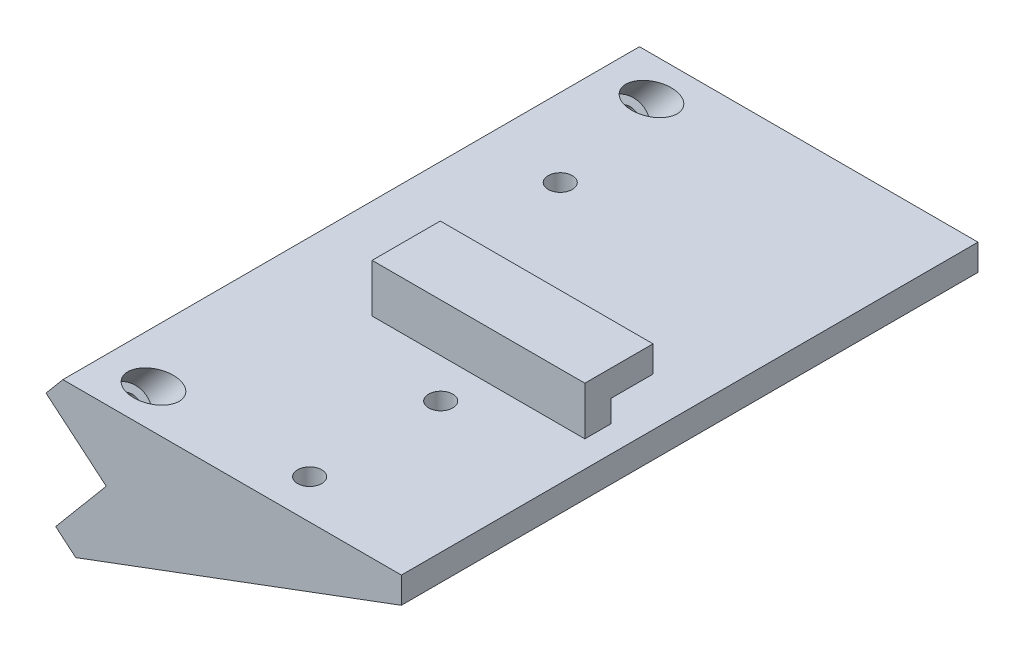
ISO-10303-21;
HEADER;
FILE_DESCRIPTION(('STEP AP214'),'2;1');
FILE_NAME('part.step','',(''),(''),'','','');
FILE_SCHEMA(('AUTOMOTIVE_DESIGN { 1 0 10303 214 1 1 1 1 }'));
ENDSEC;
DATA;
#1=APPLICATION_CONTEXT('core data for automotive mechanical design processes');
#2=APPLICATION_PROTOCOL_DEFINITION('international standard','automotive_design',2000,#1);
#3=PRODUCT_CONTEXT('',#1,'mechanical');
#4=PRODUCT('Part','Part','',(#3));
#5=PRODUCT_RELATED_PRODUCT_CATEGORY('part','',(#4));
#6=PRODUCT_DEFINITION_FORMATION('','',#4);
#7=PRODUCT_DEFINITION_CONTEXT('part definition',#1,'design');
#8=PRODUCT_DEFINITION('design','',#6,#7);
#9=PRODUCT_DEFINITION_SHAPE('','',#8);
#10=(LENGTH_UNIT() NAMED_UNIT(*) SI_UNIT(.MILLI.,.METRE.));
#11=(NAMED_UNIT(*) PLANE_ANGLE_UNIT() SI_UNIT($,.RADIAN.));
#12=(NAMED_UNIT(*) SI_UNIT($,.STERADIAN.) SOLID_ANGLE_UNIT());
#13=UNCERTAINTY_MEASURE_WITH_UNIT(LENGTH_MEASURE(1.E-05),#10,'distance_accuracy_value','');
#14=(GEOMETRIC_REPRESENTATION_CONTEXT(3) GLOBAL_UNCERTAINTY_ASSIGNED_CONTEXT((#13)) GLOBAL_UNIT_ASSIGNED_CONTEXT((#10,
#11,#12)) REPRESENTATION_CONTEXT('',''));
#15=CARTESIAN_POINT('',(0.,0.,0.));
#16=DIRECTION('',(0.,0.,1.));
#17=DIRECTION('',(1.,0.,0.));
#18=AXIS2_PLACEMENT_3D('',#15,#16,#17);
#19=CARTESIAN_POINT('',(0.,0.,65.));
#20=DIRECTION('',(0.,0.,1.));
#21=DIRECTION('',(1.,0.,0.));
#22=AXIS2_PLACEMENT_3D('',#19,#20,#21);
#23=PLANE('',#22);
#24=DIRECTION('',(-1.,0.,0.));
#25=VECTOR('',#24,1.);
#26=CARTESIAN_POINT('',(65.9461948869302,29.1627030076777,65.));
#27=LINE('',#26,#25);
#28=CARTESIAN_POINT('',(60.9461948869302,29.1627030076777,65.));
#29=VERTEX_POINT('',#28);
#30=CARTESIAN_POINT('',(20.364802153777,29.1627030076777,65.));
#31=VERTEX_POINT('',#30);
#32=EDGE_CURVE('E191',#29,#31,#27,.T.);
#33=ORIENTED_EDGE('',*,*,#32,.F.);
#34=DIRECTION('',(0.,1.,0.));
#35=VECTOR('',#34,1.);
#36=CARTESIAN_POINT('',(60.9461948869302,24.9627030076777,65.));
#37=LINE('',#36,#35);
#38=CARTESIAN_POINT('',(60.9461948869302,24.9627030076777,65.));
#39=VERTEX_POINT('',#38);
#40=EDGE_CURVE('E149',#39,#29,#37,.T.);
#41=ORIENTED_EDGE('',*,*,#40,.F.);
#42=DIRECTION('',(-1.,0.,0.));
#43=VECTOR('',#42,1.);
#44=CARTESIAN_POINT('',(1.36508554694607,24.9627030076777,65.));
#45=LINE('',#44,#43);
#46=CARTESIAN_POINT('',(20.364802153777,24.9627030076777,65.));
#47=VERTEX_POINT('',#46);
#48=EDGE_CURVE('E147',#39,#47,#45,.T.);
#49=ORIENTED_EDGE('',*,*,#48,.T.);
#50=DIRECTION('',(0.,1.,0.));
#51=VECTOR('',#50,1.);
#52=CARTESIAN_POINT('',(20.364802153777,0.,65.));
#53=LINE('',#52,#51);
#54=EDGE_CURVE('E184',#47,#31,#53,.T.);
#55=ORIENTED_EDGE('',*,*,#54,.T.);
#56=EDGE_LOOP('',(#33,#41,#49,#55));
#57=FACE_BOUND('',#56,.T.);
#58=ADVANCED_FACE('F41',(#57),#23,.F.);
#59=CARTESIAN_POINT('',(3.8302222155949,-3.21393804843269,65.));
#60=DIRECTION('',(0.642787609686537,0.766044443118979,0.));
#61=DIRECTION('',(-0.76604444311898,0.642787609686537,0.));
#62=AXIS2_PLACEMENT_3D('',#59,#60,#61);
#63=PLANE('',#62);
#64=DIRECTION('',(0.76604444311898,-0.642787609686537,0.));
#65=VECTOR('',#64,1.);
#66=CARTESIAN_POINT('',(3.8302222155949,-3.21393804843269,0.));
#67=LINE('',#66,#65);
#68=CARTESIAN_POINT('',(0.,0.,0.));
#69=VERTEX_POINT('',#68);
#70=CARTESIAN_POINT('',(3.8302222155949,-3.21393804843269,0.));
#71=VERTEX_POINT('',#70);
#72=EDGE_CURVE('E202',#69,#71,#67,.T.);
#73=ORIENTED_EDGE('',*,*,#72,.T.);
#74=DIRECTION('',(0.,0.,-1.));
#75=VECTOR('',#74,1.);
#76=CARTESIAN_POINT('',(3.8302222155949,-3.21393804843269,65.));
#77=LINE('',#76,#75);
#78=CARTESIAN_POINT('',(3.8302222155949,-3.21393804843269,110.));
#79=VERTEX_POINT('',#78);
#80=EDGE_CURVE('E11',#79,#71,#77,.T.);
#81=ORIENTED_EDGE('',*,*,#80,.F.);
#82=DIRECTION('',(0.76604444311898,-0.642787609686537,0.));
#83=VECTOR('',#82,1.);
#84=CARTESIAN_POINT('',(0.,0.,110.));
#85=LINE('',#84,#83);
#86=CARTESIAN_POINT('',(0.,0.,110.));
#87=VERTEX_POINT('',#86);
#88=EDGE_CURVE('E173',#87,#79,#85,.T.);
#89=ORIENTED_EDGE('',*,*,#88,.F.);
#90=DIRECTION('',(0.,0.,-1.));
#91=VECTOR('',#90,1.);
#92=CARTESIAN_POINT('',(0.,0.,65.));
#93=LINE('',#92,#91);
#94=EDGE_CURVE('E204',#87,#69,#93,.T.);
#95=ORIENTED_EDGE('',*,*,#94,.T.);
#96=EDGE_LOOP('',(#73,#81,#89,#95));
#97=FACE_BOUND('',#96,.T.);
#98=ADVANCED_FACE('F43',(#97),#63,.F.);
#99=CARTESIAN_POINT('',(65.9461948869302,19.9627030076777,65.));
#100=DIRECTION('',(-0.349577800367252,0.936907338796315,0.));
#101=DIRECTION('',(-0.936907338796315,-0.349577800367252,0.));
#102=AXIS2_PLACEMENT_3D('',#99,#100,#101);
#103=PLANE('',#102);
#104=DIRECTION('',(0.936907338796315,0.349577800367252,0.));
#105=VECTOR('',#104,1.);
#106=CARTESIAN_POINT('',(65.9461948869302,19.9627030076777,0.));
#107=LINE('',#106,#105);
#108=CARTESIAN_POINT('',(65.9461948869302,19.9627030076777,0.));
#109=VERTEX_POINT('',#108);
#110=EDGE_CURVE('E208',#71,#109,#107,.T.);
#111=ORIENTED_EDGE('',*,*,#110,.T.);
#112=DIRECTION('',(0.,0.,-1.));
#113=VECTOR('',#112,1.);
#114=CARTESIAN_POINT('',(65.9461948869302,19.9627030076777,65.));
#115=LINE('',#114,#113);
#116=CARTESIAN_POINT('',(65.9461948869302,19.9627030076777,110.));
#117=VERTEX_POINT('',#116);
#118=EDGE_CURVE('E50',#117,#109,#115,.T.);
#119=ORIENTED_EDGE('',*,*,#118,.F.);
#120=DIRECTION('',(0.936907338796315,0.349577800367252,0.));
#121=VECTOR('',#120,1.);
#122=CARTESIAN_POINT('',(3.8302222155949,-3.21393804843269,110.));
#123=LINE('',#122,#121);
#124=EDGE_CURVE('E162',#79,#117,#123,.T.);
#125=ORIENTED_EDGE('',*,*,#124,.F.);
#126=ORIENTED_EDGE('',*,*,#80,.T.);
#127=EDGE_LOOP('',(#111,#119,#125,#126));
#128=FACE_BOUND('',#127,.T.);
#129=ADVANCED_FACE('F276',(#128),#103,.F.);
#130=CARTESIAN_POINT('',(65.9461948869302,24.9627030076777,65.));
#131=DIRECTION('',(-1.,0.,0.));
#132=DIRECTION('',(0.,-1.,0.));
#133=AXIS2_PLACEMENT_3D('',#130,#131,#132);
#134=PLANE('',#133);
#135=DIRECTION('',(0.,0.,-1.));
#136=VECTOR('',#135,1.);
#137=CARTESIAN_POINT('',(65.9461948869302,24.9627030076777,65.));
#138=LINE('',#137,#136);
#139=CARTESIAN_POINT('',(65.9461948869302,24.9627030076777,110.));
#140=VERTEX_POINT('',#139);
#141=CARTESIAN_POINT('',(65.9461948869302,24.9627030076777,0.));
#142=VERTEX_POINT('',#141);
#143=EDGE_CURVE('E230',#140,#142,#138,.T.);
#144=ORIENTED_EDGE('',*,*,#143,.F.);
#145=DIRECTION('',(0.,1.,0.));
#146=VECTOR('',#145,1.);
#147=CARTESIAN_POINT('',(65.9461948869302,19.9627030076777,110.));
#148=LINE('',#147,#146);
#149=EDGE_CURVE('E166',#117,#140,#148,.T.);
#150=ORIENTED_EDGE('',*,*,#149,.F.);
#151=ORIENTED_EDGE('',*,*,#118,.T.);
#152=DIRECTION('',(0.,1.,0.));
#153=VECTOR('',#152,1.);
#154=CARTESIAN_POINT('',(65.9461948869302,24.9627030076777,0.));
#155=LINE('',#154,#153);
#156=EDGE_CURVE('E210',#109,#142,#155,.T.);
#157=ORIENTED_EDGE('',*,*,#156,.T.);
#158=EDGE_LOOP('',(#144,#150,#151,#157));
#159=FACE_BOUND('',#158,.T.);
#160=ADVANCED_FACE('F280',(#159),#134,.F.);
#161=CARTESIAN_POINT('',(1.36508554694607,24.9627030076777,65.));
#162=DIRECTION('',(0.,-1.,0.));
#163=DIRECTION('',(1.,0.,0.));
#164=AXIS2_PLACEMENT_3D('',#161,#162,#163);
#165=PLANE('',#164);
#166=ORIENTED_EDGE('',*,*,#48,.F.);
#167=DIRECTION('',(0.,0.,-1.));
#168=VECTOR('',#167,1.);
#169=CARTESIAN_POINT('',(60.9461948869302,24.9627030076777,70.));
#170=LINE('',#169,#168);
#171=CARTESIAN_POINT('',(60.9461948869302,24.9627030076777,70.));
#172=VERTEX_POINT('',#171);
#173=EDGE_CURVE('E139',#172,#39,#170,.T.);
#174=ORIENTED_EDGE('',*,*,#173,.F.);
#175=DIRECTION('',(-1.,0.,0.));
#176=VECTOR('',#175,1.);
#177=CARTESIAN_POINT('',(65.9461948869302,24.9627030076777,70.));
#178=LINE('',#177,#176);
#179=CARTESIAN_POINT('',(20.364802153777,24.9627030076777,70.));
#180=VERTEX_POINT('',#179);
#181=EDGE_CURVE('E145',#172,#180,#178,.T.);
#182=ORIENTED_EDGE('',*,*,#181,.T.);
#183=DIRECTION('',(0.,0.,-1.));
#184=VECTOR('',#183,1.);
#185=CARTESIAN_POINT('',(20.364802153777,24.9627030076777,70.));
#186=LINE('',#185,#184);
#187=EDGE_CURVE('E178',#180,#47,#186,.T.);
#188=ORIENTED_EDGE('',*,*,#187,.T.);
#189=EDGE_LOOP('',(#166,#174,#182,#188));
#190=FACE_BOUND('',#189,.T.);
#191=CARTESIAN_POINT('',(40.9461948869302,24.9627030076777,77.5));
#192=DIRECTION('',(0.,1.,0.));
#193=DIRECTION('',(0.,0.,1.));
#194=AXIS2_PLACEMENT_3D('',#191,#192,#193);
#195=CIRCLE('',#194,2.3);
#196=CARTESIAN_POINT('',(40.9461948869302,24.9627030076777,79.8));
#197=VERTEX_POINT('',#196);
#198=EDGE_CURVE('E620',#197,#197,#195,.T.);
#199=ORIENTED_EDGE('',*,*,#198,.F.);
#200=EDGE_LOOP('',(#199));
#201=FACE_BOUND('',#200,.T.);
#202=CARTESIAN_POINT('',(40.9461948869302,24.9627030076777,102.5));
#203=DIRECTION('',(0.,1.,0.));
#204=DIRECTION('',(0.,0.,1.));
#205=AXIS2_PLACEMENT_3D('',#202,#203,#204);
#206=CIRCLE('',#205,2.3);
#207=CARTESIAN_POINT('',(40.9461948869302,24.9627030076777,104.8));
#208=VERTEX_POINT('',#207);
#209=EDGE_CURVE('E626',#208,#208,#206,.T.);
#210=ORIENTED_EDGE('',*,*,#209,.F.);
#211=EDGE_LOOP('',(#210));
#212=FACE_BOUND('',#211,.T.);
#213=CARTESIAN_POINT('',(11.1556402169381,24.9627030076777,102.5));
#214=DIRECTION('',(0.,-1.,0.));
#215=DIRECTION('',(-1.,0.,0.));
#216=AXIS2_PLACEMENT_3D('',#213,#214,#215);
#217=ELLIPSE('',#216,4.89527733499604,3.75);
#218=CARTESIAN_POINT('',(6.26036288194211,24.9627030076777,102.5));
#219=VERTEX_POINT('',#218);
#220=EDGE_CURVE('E45',#219,#219,#217,.T.);
#221=ORIENTED_EDGE('',*,*,#220,.T.);
#222=EDGE_LOOP('',(#221));
#223=FACE_BOUND('',#222,.T.);
#224=CARTESIAN_POINT('',(11.1556402169381,24.9627030076777,7.5));
#225=DIRECTION('',(0.,-1.,0.));
#226=DIRECTION('',(-1.,0.,0.));
#227=AXIS2_PLACEMENT_3D('',#224,#225,#226);
#228=ELLIPSE('',#227,4.89527733499604,3.75);
#229=CARTESIAN_POINT('',(6.26036288194211,24.9627030076777,7.5));
#230=VERTEX_POINT('',#229);
#231=EDGE_CURVE('E241',#230,#230,#228,.T.);
#232=ORIENTED_EDGE('',*,*,#231,.T.);
#233=EDGE_LOOP('',(#232));
#234=FACE_BOUND('',#233,.T.);
#235=DIRECTION('',(0.,0.,-1.));
#236=VECTOR('',#235,1.);
#237=CARTESIAN_POINT('',(1.36508554694607,24.9627030076777,65.));
#238=LINE('',#237,#236);
#239=CARTESIAN_POINT('',(1.36508554694607,24.9627030076777,110.));
#240=VERTEX_POINT('',#239);
#241=CARTESIAN_POINT('',(1.36508554694607,24.9627030076777,0.));
#242=VERTEX_POINT('',#241);
#243=EDGE_CURVE('E228',#240,#242,#238,.T.);
#244=ORIENTED_EDGE('',*,*,#243,.F.);
#245=DIRECTION('',(-1.,0.,0.));
#246=VECTOR('',#245,1.);
#247=CARTESIAN_POINT('',(65.9461948869302,24.9627030076777,110.));
#248=LINE('',#247,#246);
#249=EDGE_CURVE('E258',#140,#240,#248,.T.);
#250=ORIENTED_EDGE('',*,*,#249,.F.);
#251=ORIENTED_EDGE('',*,*,#143,.T.);
#252=DIRECTION('',(-1.,0.,0.));
#253=VECTOR('',#252,1.);
#254=CARTESIAN_POINT('',(1.36508554694607,24.9627030076777,0.));
#255=LINE('',#254,#253);
#256=EDGE_CURVE('E212',#142,#242,#255,.T.);
#257=ORIENTED_EDGE('',*,*,#256,.T.);
#258=EDGE_LOOP('',(#244,#250,#251,#257));
#259=FACE_BOUND('',#258,.T.);
#260=CARTESIAN_POINT('',(16.2550855469461,24.9627030076777,30.));
#261=DIRECTION('',(0.,1.,0.));
#262=DIRECTION('',(-1.,0.,0.));
#263=AXIS2_PLACEMENT_3D('',#260,#261,#262);
#264=CIRCLE('',#263,2.3);
#265=CARTESIAN_POINT('',(13.9550855469461,24.9627030076777,30.));
#266=VERTEX_POINT('',#265);
#267=EDGE_CURVE('E187',#266,#266,#264,.T.);
#268=ORIENTED_EDGE('',*,*,#267,.F.);
#269=EDGE_LOOP('',(#268));
#270=FACE_BOUND('',#269,.T.);
#271=ADVANCED_FACE('F141',(#190,#201,#212,#223,#234,#259,#270),#165,.F.);
#272=CARTESIAN_POINT('',(-1.84885250148662,21.1324807920828,65.));
#273=DIRECTION('',(0.766044443118979,-0.642787609686538,0.));
#274=DIRECTION('',(0.642787609686538,0.76604444311898,0.));
#275=AXIS2_PLACEMENT_3D('',#272,#273,#274);
#276=PLANE('',#275);
#277=DIRECTION('',(0.,0.,-1.));
#278=VECTOR('',#277,1.);
#279=CARTESIAN_POINT('',(-1.84885250148662,21.1324807920828,65.));
#280=LINE('',#279,#278);
#281=CARTESIAN_POINT('',(-1.84885250148662,21.1324807920828,110.));
#282=VERTEX_POINT('',#281);
#283=CARTESIAN_POINT('',(-1.84885250148662,21.1324807920828,0.));
#284=VERTEX_POINT('',#283);
#285=EDGE_CURVE('E225',#282,#284,#280,.T.);
#286=ORIENTED_EDGE('',*,*,#285,.F.);
#287=DIRECTION('',(-0.642787609686538,-0.766044443118979,0.));
#288=VECTOR('',#287,1.);
#289=CARTESIAN_POINT('',(1.36508554694607,24.9627030076777,110.));
#290=LINE('',#289,#288);
#291=EDGE_CURVE('E261',#240,#282,#290,.T.);
#292=ORIENTED_EDGE('',*,*,#291,.F.);
#293=ORIENTED_EDGE('',*,*,#243,.T.);
#294=DIRECTION('',(-0.642787609686538,-0.766044443118979,0.));
#295=VECTOR('',#294,1.);
#296=CARTESIAN_POINT('',(-1.84885250148662,21.1324807920828,0.));
#297=LINE('',#296,#295);
#298=EDGE_CURVE('E215',#242,#284,#297,.T.);
#299=ORIENTED_EDGE('',*,*,#298,.T.);
#300=EDGE_LOOP('',(#286,#292,#293,#299));
#301=FACE_BOUND('',#300,.T.);
#302=ADVANCED_FACE('F288',(#301),#276,.F.);
#303=CARTESIAN_POINT('',(9.64181414529807,11.4906666467847,65.));
#304=DIRECTION('',(0.642787609686538,0.766044443118979,0.));
#305=DIRECTION('',(-0.766044443118979,0.642787609686538,0.));
#306=AXIS2_PLACEMENT_3D('',#303,#304,#305);
#307=PLANE('',#306);
#308=CARTESIAN_POINT('',(3.89648082190573,16.3115737194337,102.5));
#309=DIRECTION('',(-0.642787609686538,-0.766044443118979,0.));
#310=DIRECTION('',(0.766044443118979,-0.642787609686538,0.));
#311=AXIS2_PLACEMENT_3D('',#308,#309,#310);
#312=CIRCLE('',#311,2.24999999999999);
#313=CARTESIAN_POINT('',(5.62008081892342,14.865301597639,102.5));
#314=VERTEX_POINT('',#313);
#315=EDGE_CURVE('E169',#314,#314,#312,.T.);
#316=ORIENTED_EDGE('',*,*,#315,.F.);
#317=EDGE_LOOP('',(#316));
#318=FACE_BOUND('',#317,.T.);
#319=CARTESIAN_POINT('',(3.89648082190573,16.3115737194337,7.5));
#320=DIRECTION('',(-0.642787609686538,-0.766044443118979,0.));
#321=DIRECTION('',(0.766044443118979,-0.642787609686538,0.));
#322=AXIS2_PLACEMENT_3D('',#319,#320,#321);
#323=CIRCLE('',#322,2.24999999999999);
#324=CARTESIAN_POINT('',(5.62008081892343,14.865301597639,7.5));
#325=VERTEX_POINT('',#324);
#326=EDGE_CURVE('E163',#325,#325,#323,.T.);
#327=ORIENTED_EDGE('',*,*,#326,.F.);
#328=EDGE_LOOP('',(#327));
#329=FACE_BOUND('',#328,.T.);
#330=DIRECTION('',(0.766044443118979,-0.642787609686538,0.));
#331=VECTOR('',#330,1.);
#332=CARTESIAN_POINT('',(9.64181414529807,11.4906666467847,0.));
#333=LINE('',#332,#331);
#334=CARTESIAN_POINT('',(9.64181414529807,11.4906666467847,0.));
#335=VERTEX_POINT('',#334);
#336=EDGE_CURVE('E217',#284,#335,#333,.T.);
#337=ORIENTED_EDGE('',*,*,#336,.T.);
#338=DIRECTION('',(0.,0.,-1.));
#339=VECTOR('',#338,1.);
#340=CARTESIAN_POINT('',(9.64181414529807,11.4906666467847,65.));
#341=LINE('',#340,#339);
#342=CARTESIAN_POINT('',(9.64181414529807,11.4906666467847,110.));
#343=VERTEX_POINT('',#342);
#344=EDGE_CURVE('E222',#343,#335,#341,.T.);
#345=ORIENTED_EDGE('',*,*,#344,.F.);
#346=DIRECTION('',(0.766044443118979,-0.642787609686538,0.));
#347=VECTOR('',#346,1.);
#348=CARTESIAN_POINT('',(-1.84885250148662,21.1324807920828,110.));
#349=LINE('',#348,#347);
#350=EDGE_CURVE('E264',#282,#343,#349,.T.);
#351=ORIENTED_EDGE('',*,*,#350,.F.);
#352=ORIENTED_EDGE('',*,*,#285,.T.);
#353=EDGE_LOOP('',(#337,#345,#351,#352));
#354=FACE_BOUND('',#353,.T.);
#355=ADVANCED_FACE('F291',(#318,#329,#354),#307,.F.);
#356=CARTESIAN_POINT('',(0.,0.,65.));
#357=DIRECTION('',(0.766044443118979,-0.642787609686538,0.));
#358=DIRECTION('',(0.642787609686538,0.766044443118979,0.));
#359=AXIS2_PLACEMENT_3D('',#356,#357,#358);
#360=PLANE('',#359);
#361=DIRECTION('',(-0.642787609686538,-0.766044443118979,0.));
#362=VECTOR('',#361,1.);
#363=CARTESIAN_POINT('',(0.,0.,0.));
#364=LINE('',#363,#362);
#365=EDGE_CURVE('E205',#335,#69,#364,.T.);
#366=ORIENTED_EDGE('',*,*,#365,.T.);
#367=ORIENTED_EDGE('',*,*,#94,.F.);
#368=DIRECTION('',(-0.642787609686538,-0.766044443118979,0.));
#369=VECTOR('',#368,1.);
#370=CARTESIAN_POINT('',(9.64181414529807,11.4906666467847,110.));
#371=LINE('',#370,#369);
#372=EDGE_CURVE('E266',#343,#87,#371,.T.);
#373=ORIENTED_EDGE('',*,*,#372,.F.);
#374=ORIENTED_EDGE('',*,*,#344,.T.);
#375=EDGE_LOOP('',(#366,#367,#373,#374));
#376=FACE_BOUND('',#375,.T.);
#377=ADVANCED_FACE('F295',(#376),#360,.F.);
#378=CARTESIAN_POINT('',(0.,0.,0.));
#379=DIRECTION('',(0.,0.,-1.));
#380=DIRECTION('',(-1.,0.,0.));
#381=AXIS2_PLACEMENT_3D('',#378,#379,#380);
#382=PLANE('',#381);
#383=ORIENTED_EDGE('',*,*,#72,.F.);
#384=ORIENTED_EDGE('',*,*,#365,.F.);
#385=ORIENTED_EDGE('',*,*,#336,.F.);
#386=ORIENTED_EDGE('',*,*,#298,.F.);
#387=ORIENTED_EDGE('',*,*,#256,.F.);
#388=ORIENTED_EDGE('',*,*,#156,.F.);
#389=ORIENTED_EDGE('',*,*,#110,.F.);
#390=EDGE_LOOP('',(#383,#384,#385,#386,#387,#388,#389));
#391=FACE_BOUND('',#390,.T.);
#392=ADVANCED_FACE('F298',(#391),#382,.T.);
#393=CARTESIAN_POINT('',(65.9461948869302,34.1627030076776,70.));
#394=DIRECTION('',(0.,-1.,0.));
#395=DIRECTION('',(0.,0.,-1.));
#396=AXIS2_PLACEMENT_3D('',#393,#394,#395);
#397=PLANE('',#396);
#398=DIRECTION('',(-1.,0.,0.));
#399=VECTOR('',#398,1.);
#400=CARTESIAN_POINT('',(65.9461948869302,34.1627030076776,70.));
#401=LINE('',#400,#399);
#402=CARTESIAN_POINT('',(60.9461948869302,34.1627030076777,70.));
#403=VERTEX_POINT('',#402);
#404=CARTESIAN_POINT('',(20.364802153777,34.1627030076776,70.));
#405=VERTEX_POINT('',#404);
#406=EDGE_CURVE('E199',#403,#405,#401,.T.);
#407=ORIENTED_EDGE('',*,*,#406,.F.);
#408=DIRECTION('',(0.,0.,1.));
#409=VECTOR('',#408,1.);
#410=CARTESIAN_POINT('',(60.9461948869302,34.1627030076777,70.));
#411=LINE('',#410,#409);
#412=CARTESIAN_POINT('',(60.9461948869302,34.1627030076777,57.));
#413=VERTEX_POINT('',#412);
#414=EDGE_CURVE('E155',#413,#403,#411,.T.);
#415=ORIENTED_EDGE('',*,*,#414,.F.);
#416=DIRECTION('',(1.,0.,0.));
#417=VECTOR('',#416,1.);
#418=CARTESIAN_POINT('',(9.08480215377701,34.1627030076776,57.));
#419=LINE('',#418,#417);
#420=CARTESIAN_POINT('',(20.364802153777,34.1627030076776,57.));
#421=VERTEX_POINT('',#420);
#422=EDGE_CURVE('E194',#421,#413,#419,.T.);
#423=ORIENTED_EDGE('',*,*,#422,.F.);
#424=DIRECTION('',(0.,0.,-1.));
#425=VECTOR('',#424,1.);
#426=CARTESIAN_POINT('',(20.364802153777,34.1627030076776,70.));
#427=LINE('',#426,#425);
#428=EDGE_CURVE('E66',#405,#421,#427,.T.);
#429=ORIENTED_EDGE('',*,*,#428,.F.);
#430=EDGE_LOOP('',(#407,#415,#423,#429));
#431=FACE_BOUND('',#430,.T.);
#432=ADVANCED_FACE('F315',(#431),#397,.F.);
#433=CARTESIAN_POINT('',(0.,0.,70.));
#434=DIRECTION('',(0.,0.,1.));
#435=DIRECTION('',(1.,0.,0.));
#436=AXIS2_PLACEMENT_3D('',#433,#434,#435);
#437=PLANE('',#436);
#438=DIRECTION('',(0.,-1.,0.));
#439=VECTOR('',#438,1.);
#440=CARTESIAN_POINT('',(60.9461948869302,24.9627030076777,70.));
#441=LINE('',#440,#439);
#442=EDGE_CURVE('E150',#403,#172,#441,.T.);
#443=ORIENTED_EDGE('',*,*,#442,.F.);
#444=ORIENTED_EDGE('',*,*,#406,.T.);
#445=DIRECTION('',(0.,-1.,0.));
#446=VECTOR('',#445,1.);
#447=CARTESIAN_POINT('',(20.364802153777,34.1627030076776,70.));
#448=LINE('',#447,#446);
#449=EDGE_CURVE('E161',#405,#180,#448,.T.);
#450=ORIENTED_EDGE('',*,*,#449,.T.);
#451=ORIENTED_EDGE('',*,*,#181,.F.);
#452=EDGE_LOOP('',(#443,#444,#450,#451));
#453=FACE_BOUND('',#452,.T.);
#454=ADVANCED_FACE('F160',(#453),#437,.T.);
#455=CARTESIAN_POINT('',(65.9461948869302,29.1627030076777,57.));
#456=DIRECTION('',(0.,1.,0.));
#457=DIRECTION('',(-1.,0.,0.));
#458=AXIS2_PLACEMENT_3D('',#455,#456,#457);
#459=PLANE('',#458);
#460=DIRECTION('',(-1.,0.,0.));
#461=VECTOR('',#460,1.);
#462=CARTESIAN_POINT('',(65.9461948869302,29.1627030076777,57.));
#463=LINE('',#462,#461);
#464=CARTESIAN_POINT('',(60.9461948869302,29.1627030076777,57.));
#465=VERTEX_POINT('',#464);
#466=CARTESIAN_POINT('',(20.364802153777,29.1627030076777,57.));
#467=VERTEX_POINT('',#466);
#468=EDGE_CURVE('E197',#465,#467,#463,.T.);
#469=ORIENTED_EDGE('',*,*,#468,.F.);
#470=DIRECTION('',(0.,0.,-1.));
#471=VECTOR('',#470,1.);
#472=CARTESIAN_POINT('',(60.9461948869302,29.1627030076777,57.));
#473=LINE('',#472,#471);
#474=EDGE_CURVE('E58',#29,#465,#473,.T.);
#475=ORIENTED_EDGE('',*,*,#474,.F.);
#476=ORIENTED_EDGE('',*,*,#32,.T.);
#477=DIRECTION('',(0.,0.,-1.));
#478=VECTOR('',#477,1.);
#479=CARTESIAN_POINT('',(20.364802153777,29.1627030076777,57.));
#480=LINE('',#479,#478);
#481=EDGE_CURVE('E180',#31,#467,#480,.T.);
#482=ORIENTED_EDGE('',*,*,#481,.T.);
#483=EDGE_LOOP('',(#469,#475,#476,#482));
#484=FACE_BOUND('',#483,.T.);
#485=ADVANCED_FACE('F354',(#484),#459,.F.);
#486=CARTESIAN_POINT('',(0.,0.,57.));
#487=DIRECTION('',(0.,0.,-1.));
#488=DIRECTION('',(-1.,0.,0.));
#489=AXIS2_PLACEMENT_3D('',#486,#487,#488);
#490=PLANE('',#489);
#491=DIRECTION('',(0.,1.,0.));
#492=VECTOR('',#491,1.);
#493=CARTESIAN_POINT('',(60.9461948869302,34.1627030076777,57.));
#494=LINE('',#493,#492);
#495=EDGE_CURVE('E615',#465,#413,#494,.T.);
#496=ORIENTED_EDGE('',*,*,#495,.F.);
#497=ORIENTED_EDGE('',*,*,#468,.T.);
#498=DIRECTION('',(0.,-1.,0.));
#499=VECTOR('',#498,1.);
#500=CARTESIAN_POINT('',(20.364802153777,34.1627030076776,57.));
#501=LINE('',#500,#499);
#502=EDGE_CURVE('E176',#421,#467,#501,.T.);
#503=ORIENTED_EDGE('',*,*,#502,.F.);
#504=ORIENTED_EDGE('',*,*,#422,.T.);
#505=EDGE_LOOP('',(#496,#497,#503,#504));
#506=FACE_BOUND('',#505,.T.);
#507=ADVANCED_FACE('F361',(#506),#490,.T.);
#508=CARTESIAN_POINT('',(16.2550855469461,21.4627030076777,30.));
#509=DIRECTION('',(0.,1.,0.));
#510=DIRECTION('',(-1.,0.,0.));
#511=AXIS2_PLACEMENT_3D('',#508,#509,#510);
#512=CYLINDRICAL_SURFACE('',#511,2.3);
#513=CARTESIAN_POINT('',(16.2550855469461,21.4627030076777,30.));
#514=DIRECTION('',(0.,1.,0.));
#515=DIRECTION('',(-1.,0.,0.));
#516=AXIS2_PLACEMENT_3D('',#513,#514,#515);
#517=CIRCLE('',#516,2.3);
#518=CARTESIAN_POINT('',(13.9550855469461,21.4627030076777,30.));
#519=VERTEX_POINT('',#518);
#520=EDGE_CURVE('E188',#519,#519,#517,.T.);
#521=ORIENTED_EDGE('',*,*,#520,.F.);
#522=EDGE_LOOP('',(#521));
#523=FACE_BOUND('',#522,.T.);
#524=ORIENTED_EDGE('',*,*,#267,.T.);
#525=EDGE_LOOP('',(#524));
#526=FACE_BOUND('',#525,.T.);
#527=ADVANCED_FACE('F369',(#523,#526),#512,.F.);
#528=CARTESIAN_POINT('',(16.2550855469461,21.4627030076777,30.));
#529=DIRECTION('',(0.,1.,0.));
#530=DIRECTION('',(-1.,0.,0.));
#531=AXIS2_PLACEMENT_3D('',#528,#529,#530);
#532=PLANE('',#531);
#533=ORIENTED_EDGE('',*,*,#520,.T.);
#534=EDGE_LOOP('',(#533));
#535=FACE_BOUND('',#534,.T.);
#536=ADVANCED_FACE('F484',(#535),#532,.T.);
#537=CARTESIAN_POINT('',(20.364802153777,34.1627030076776,70.));
#538=DIRECTION('',(1.,0.,0.));
#539=DIRECTION('',(0.,0.,-1.));
#540=AXIS2_PLACEMENT_3D('',#537,#538,#539);
#541=PLANE('',#540);
#542=ORIENTED_EDGE('',*,*,#187,.F.);
#543=ORIENTED_EDGE('',*,*,#449,.F.);
#544=ORIENTED_EDGE('',*,*,#428,.T.);
#545=ORIENTED_EDGE('',*,*,#502,.T.);
#546=ORIENTED_EDGE('',*,*,#481,.F.);
#547=ORIENTED_EDGE('',*,*,#54,.F.);
#548=EDGE_LOOP('',(#542,#543,#544,#545,#546,#547));
#549=FACE_BOUND('',#548,.T.);
#550=ADVANCED_FACE('F475',(#549),#541,.F.);
#551=CARTESIAN_POINT('',(0.,0.,110.));
#552=DIRECTION('',(0.,0.,1.));
#553=DIRECTION('',(1.,0.,0.));
#554=AXIS2_PLACEMENT_3D('',#551,#552,#553);
#555=PLANE('',#554);
#556=ORIENTED_EDGE('',*,*,#124,.T.);
#557=ORIENTED_EDGE('',*,*,#149,.T.);
#558=ORIENTED_EDGE('',*,*,#249,.T.);
#559=ORIENTED_EDGE('',*,*,#291,.T.);
#560=ORIENTED_EDGE('',*,*,#350,.T.);
#561=ORIENTED_EDGE('',*,*,#372,.T.);
#562=ORIENTED_EDGE('',*,*,#88,.T.);
#563=EDGE_LOOP('',(#556,#557,#558,#559,#560,#561,#562));
#564=FACE_BOUND('',#563,.T.);
#565=ADVANCED_FACE('F273',(#564),#555,.T.);
#566=CARTESIAN_POINT('',(3.89648082190573,16.3115737194337,7.5));
#567=DIRECTION('',(-0.642787609686538,-0.766044443118979,0.));
#568=DIRECTION('',(0.766044443118979,-0.642787609686538,0.));
#569=AXIS2_PLACEMENT_3D('',#566,#567,#568);
#570=CYLINDRICAL_SURFACE('',#569,2.24999999999999);
#571=CARTESIAN_POINT('',(6.14623745580861,18.9927292703502,7.5));
#572=DIRECTION('',(-0.642787609686538,-0.766044443118979,0.));
#573=DIRECTION('',(0.766044443118979,-0.642787609686538,0.));
#574=AXIS2_PLACEMENT_3D('',#571,#572,#573);
#575=CIRCLE('',#574,2.24999999999999);
#576=CARTESIAN_POINT('',(7.86983745282631,17.5464571485555,7.5));
#577=VERTEX_POINT('',#576);
#578=EDGE_CURVE('E238',#577,#577,#575,.F.);
#579=ORIENTED_EDGE('',*,*,#578,.T.);
#580=EDGE_LOOP('',(#579));
#581=FACE_BOUND('',#580,.T.);
#582=ORIENTED_EDGE('',*,*,#326,.T.);
#583=EDGE_LOOP('',(#582));
#584=FACE_BOUND('',#583,.T.);
#585=ADVANCED_FACE('F458',(#581,#584),#570,.F.);
#586=CARTESIAN_POINT('',(3.89648082190573,16.3115737194337,102.5));
#587=DIRECTION('',(-0.642787609686538,-0.766044443118979,0.));
#588=DIRECTION('',(0.766044443118979,-0.642787609686538,0.));
#589=AXIS2_PLACEMENT_3D('',#586,#587,#588);
#590=CYLINDRICAL_SURFACE('',#589,2.24999999999999);
#591=CARTESIAN_POINT('',(6.14623745580861,18.9927292703502,102.5));
#592=DIRECTION('',(-0.642787609686538,-0.766044443118979,0.));
#593=DIRECTION('',(0.766044443118979,-0.642787609686538,0.));
#594=AXIS2_PLACEMENT_3D('',#591,#592,#593);
#595=CIRCLE('',#594,2.24999999999999);
#596=CARTESIAN_POINT('',(7.86983745282631,17.5464571485555,102.5));
#597=VERTEX_POINT('',#596);
#598=EDGE_CURVE('E235',#597,#597,#595,.F.);
#599=ORIENTED_EDGE('',*,*,#598,.T.);
#600=EDGE_LOOP('',(#599));
#601=FACE_BOUND('',#600,.T.);
#602=ORIENTED_EDGE('',*,*,#315,.T.);
#603=EDGE_LOOP('',(#602));
#604=FACE_BOUND('',#603,.T.);
#605=ADVANCED_FACE('F449',(#601,#604),#590,.F.);
#606=CARTESIAN_POINT('',(38.323893229888,57.3405661403692,102.5));
#607=DIRECTION('',(-0.642787609686538,-0.766044443118979,0.));
#608=DIRECTION('',(0.766044443118979,-0.642787609686538,0.));
#609=AXIS2_PLACEMENT_3D('',#606,#607,#608);
#610=CYLINDRICAL_SURFACE('',#609,3.75);
#611=CARTESIAN_POINT('',(6.14623745580861,18.9927292703502,102.5));
#612=DIRECTION('',(-0.642787609686538,-0.766044443118979,0.));
#613=DIRECTION('',(0.766044443118979,-0.642787609686538,0.));
#614=AXIS2_PLACEMENT_3D('',#611,#612,#613);
#615=CIRCLE('',#614,3.75);
#616=CARTESIAN_POINT('',(9.01890411750479,16.5822757340256,102.5));
#617=VERTEX_POINT('',#616);
#618=EDGE_CURVE('E239',#617,#617,#615,.T.);
#619=ORIENTED_EDGE('',*,*,#618,.T.);
#620=EDGE_LOOP('',(#619));
#621=FACE_BOUND('',#620,.T.);
#622=ORIENTED_EDGE('',*,*,#220,.F.);
#623=EDGE_LOOP('',(#622));
#624=FACE_BOUND('',#623,.T.);
#625=ADVANCED_FACE('F440',(#621,#624),#610,.F.);
#626=CARTESIAN_POINT('',(6.14623745580861,18.9927292703502,102.5));
#627=DIRECTION('',(-0.642787609686538,-0.766044443118979,0.));
#628=DIRECTION('',(0.766044443118979,-0.642787609686538,0.));
#629=AXIS2_PLACEMENT_3D('',#626,#627,#628);
#630=PLANE('',#629);
#631=ORIENTED_EDGE('',*,*,#618,.F.);
#632=EDGE_LOOP('',(#631));
#633=FACE_BOUND('',#632,.T.);
#634=ORIENTED_EDGE('',*,*,#598,.F.);
#635=EDGE_LOOP('',(#634));
#636=FACE_BOUND('',#635,.T.);
#637=ADVANCED_FACE('F431',(#633,#636),#630,.F.);
#638=CARTESIAN_POINT('',(38.323893229888,57.3405661403692,7.5));
#639=DIRECTION('',(-0.642787609686538,-0.766044443118979,0.));
#640=DIRECTION('',(0.766044443118979,-0.642787609686538,0.));
#641=AXIS2_PLACEMENT_3D('',#638,#639,#640);
#642=CYLINDRICAL_SURFACE('',#641,3.75);
#643=CARTESIAN_POINT('',(6.14623745580861,18.9927292703502,7.5));
#644=DIRECTION('',(-0.642787609686538,-0.766044443118979,0.));
#645=DIRECTION('',(0.766044443118979,-0.642787609686538,0.));
#646=AXIS2_PLACEMENT_3D('',#643,#644,#645);
#647=CIRCLE('',#646,3.75);
#648=CARTESIAN_POINT('',(9.01890411750479,16.5822757340256,7.5));
#649=VERTEX_POINT('',#648);
#650=EDGE_CURVE('E253',#649,#649,#647,.T.);
#651=ORIENTED_EDGE('',*,*,#650,.T.);
#652=EDGE_LOOP('',(#651));
#653=FACE_BOUND('',#652,.T.);
#654=ORIENTED_EDGE('',*,*,#231,.F.);
#655=EDGE_LOOP('',(#654));
#656=FACE_BOUND('',#655,.T.);
#657=ADVANCED_FACE('F422',(#653,#656),#642,.F.);
#658=CARTESIAN_POINT('',(6.14623745580861,18.9927292703502,7.5));
#659=DIRECTION('',(-0.642787609686538,-0.766044443118979,0.));
#660=DIRECTION('',(0.766044443118979,-0.642787609686538,0.));
#661=AXIS2_PLACEMENT_3D('',#658,#659,#660);
#662=PLANE('',#661);
#663=ORIENTED_EDGE('',*,*,#650,.F.);
#664=EDGE_LOOP('',(#663));
#665=FACE_BOUND('',#664,.T.);
#666=ORIENTED_EDGE('',*,*,#578,.F.);
#667=EDGE_LOOP('',(#666));
#668=FACE_BOUND('',#667,.T.);
#669=ADVANCED_FACE('F413',(#665,#668),#662,.F.);
#670=CARTESIAN_POINT('',(40.9461948869302,21.4627030076777,102.5));
#671=DIRECTION('',(0.,-1.,0.));
#672=DIRECTION('',(0.,0.,-1.));
#673=AXIS2_PLACEMENT_3D('',#670,#671,#672);
#674=PLANE('',#673);
#675=CARTESIAN_POINT('',(40.9461948869302,21.4627030076777,102.5));
#676=DIRECTION('',(0.,1.,0.));
#677=DIRECTION('',(0.,0.,1.));
#678=AXIS2_PLACEMENT_3D('',#675,#676,#677);
#679=CIRCLE('',#678,2.3);
#680=CARTESIAN_POINT('',(40.9461948869302,21.4627030076777,104.8));
#681=VERTEX_POINT('',#680);
#682=EDGE_CURVE('E629',#681,#681,#679,.T.);
#683=ORIENTED_EDGE('',*,*,#682,.T.);
#684=EDGE_LOOP('',(#683));
#685=FACE_BOUND('',#684,.T.);
#686=ADVANCED_FACE('F404',(#685),#674,.F.);
#687=CARTESIAN_POINT('',(40.9461948869302,24.9627030076777,102.5));
#688=DIRECTION('',(0.,1.,0.));
#689=DIRECTION('',(0.,0.,1.));
#690=AXIS2_PLACEMENT_3D('',#687,#688,#689);
#691=CYLINDRICAL_SURFACE('',#690,2.3);
#692=ORIENTED_EDGE('',*,*,#682,.F.);
#693=EDGE_LOOP('',(#692));
#694=FACE_BOUND('',#693,.T.);
#695=ORIENTED_EDGE('',*,*,#209,.T.);
#696=EDGE_LOOP('',(#695));
#697=FACE_BOUND('',#696,.T.);
#698=ADVANCED_FACE('F395',(#694,#697),#691,.F.);
#699=CARTESIAN_POINT('',(40.9461948869302,21.4627030076777,77.5));
#700=DIRECTION('',(0.,-1.,0.));
#701=DIRECTION('',(0.,0.,-1.));
#702=AXIS2_PLACEMENT_3D('',#699,#700,#701);
#703=PLANE('',#702);
#704=CARTESIAN_POINT('',(40.9461948869302,21.4627030076777,77.5));
#705=DIRECTION('',(0.,1.,0.));
#706=DIRECTION('',(0.,0.,1.));
#707=AXIS2_PLACEMENT_3D('',#704,#705,#706);
#708=CIRCLE('',#707,2.3);
#709=CARTESIAN_POINT('',(40.9461948869302,21.4627030076777,79.8));
#710=VERTEX_POINT('',#709);
#711=EDGE_CURVE('E623',#710,#710,#708,.T.);
#712=ORIENTED_EDGE('',*,*,#711,.T.);
#713=EDGE_LOOP('',(#712));
#714=FACE_BOUND('',#713,.T.);
#715=ADVANCED_FACE('F386',(#714),#703,.F.);
#716=CARTESIAN_POINT('',(40.9461948869302,24.9627030076777,77.5));
#717=DIRECTION('',(0.,1.,0.));
#718=DIRECTION('',(0.,0.,1.));
#719=AXIS2_PLACEMENT_3D('',#716,#717,#718);
#720=CYLINDRICAL_SURFACE('',#719,2.3);
#721=ORIENTED_EDGE('',*,*,#711,.F.);
#722=EDGE_LOOP('',(#721));
#723=FACE_BOUND('',#722,.T.);
#724=ORIENTED_EDGE('',*,*,#198,.T.);
#725=EDGE_LOOP('',(#724));
#726=FACE_BOUND('',#725,.T.);
#727=ADVANCED_FACE('F377',(#723,#726),#720,.F.);
#728=CARTESIAN_POINT('',(60.9461948869301,-1.85075972925576E-13,0.));
#729=DIRECTION('',(-1.,0.,0.));
#730=DIRECTION('',(0.,-1.,0.));
#731=AXIS2_PLACEMENT_3D('',#728,#729,#730);
#732=PLANE('',#731);
#733=ORIENTED_EDGE('',*,*,#442,.T.);
#734=ORIENTED_EDGE('',*,*,#173,.T.);
#735=ORIENTED_EDGE('',*,*,#40,.T.);
#736=ORIENTED_EDGE('',*,*,#474,.T.);
#737=ORIENTED_EDGE('',*,*,#495,.T.);
#738=ORIENTED_EDGE('',*,*,#414,.T.);
#739=EDGE_LOOP('',(#733,#734,#735,#736,#737,#738));
#740=FACE_BOUND('',#739,.T.);
#741=ADVANCED_FACE('F153',(#740),#732,.F.);
#742=CLOSED_SHELL('',(#58,#98,#129,#160,#271,#302,#355,#377,#392,#432,#454,#485,#507,#527,#536,
#550,#565,#585,#605,#625,#637,#657,#669,#686,#698,#715,#727,#741));
#743=MANIFOLD_SOLID_BREP('B2',#742);
#744=ADVANCED_BREP_SHAPE_REPRESENTATION('',(#18,#743),#14);
#745=SHAPE_DEFINITION_REPRESENTATION(#9,#744);
ENDSEC;
END-ISO-10303-21;
